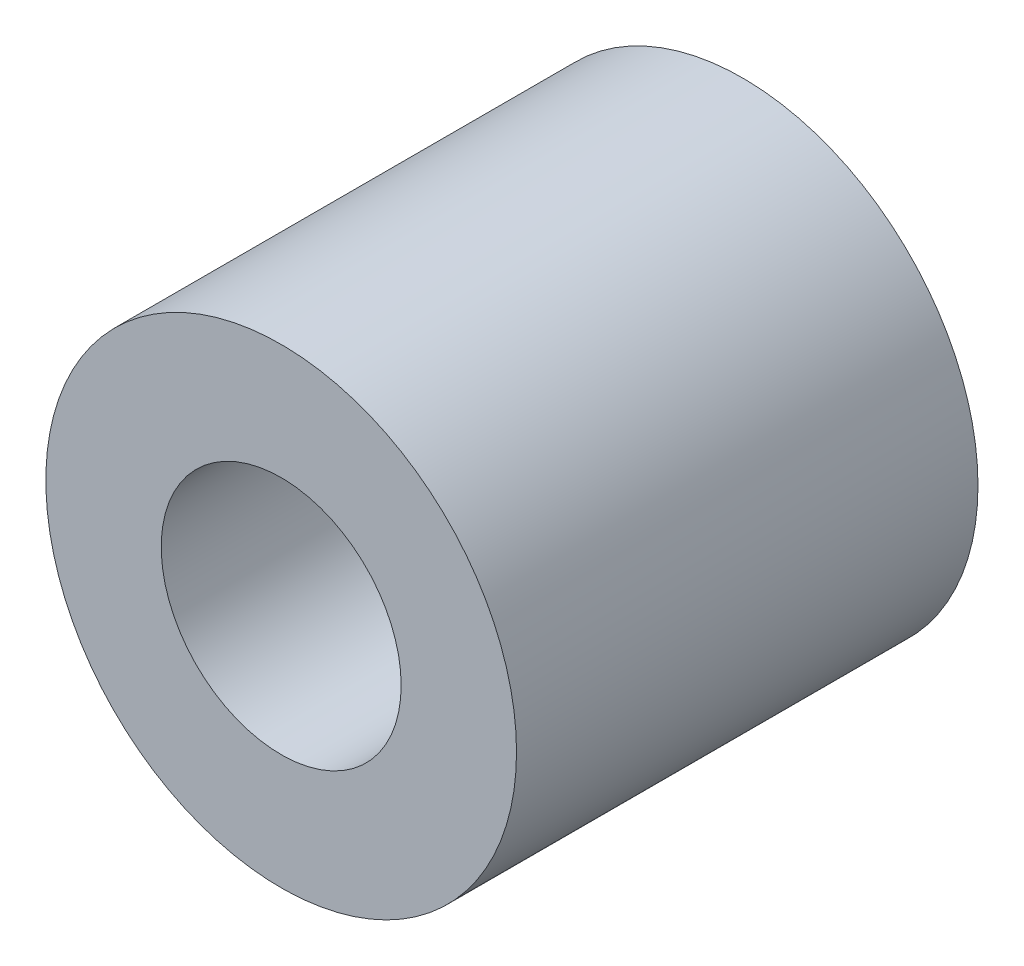
ISO-10303-21;
HEADER;
FILE_DESCRIPTION(('STEP AP214'),'2;1');
FILE_NAME('part.step','',(''),(''),'','','');
FILE_SCHEMA(('AUTOMOTIVE_DESIGN { 1 0 10303 214 1 1 1 1 }'));
ENDSEC;
DATA;
#1=APPLICATION_CONTEXT('core data for automotive mechanical design processes');
#2=APPLICATION_PROTOCOL_DEFINITION('international standard','automotive_design',2000,#1);
#3=PRODUCT_CONTEXT('',#1,'mechanical');
#4=PRODUCT('Part','Part','',(#3));
#5=PRODUCT_RELATED_PRODUCT_CATEGORY('part','',(#4));
#6=PRODUCT_DEFINITION_FORMATION('','',#4);
#7=PRODUCT_DEFINITION_CONTEXT('part definition',#1,'design');
#8=PRODUCT_DEFINITION('design','',#6,#7);
#9=PRODUCT_DEFINITION_SHAPE('','',#8);
#10=(LENGTH_UNIT() NAMED_UNIT(*) SI_UNIT(.MILLI.,.METRE.));
#11=(NAMED_UNIT(*) PLANE_ANGLE_UNIT() SI_UNIT($,.RADIAN.));
#12=(NAMED_UNIT(*) SI_UNIT($,.STERADIAN.) SOLID_ANGLE_UNIT());
#13=UNCERTAINTY_MEASURE_WITH_UNIT(LENGTH_MEASURE(1.E-05),#10,'distance_accuracy_value','');
#14=(GEOMETRIC_REPRESENTATION_CONTEXT(3) GLOBAL_UNCERTAINTY_ASSIGNED_CONTEXT((#13)) GLOBAL_UNIT_ASSIGNED_CONTEXT((#10,
#11,#12)) REPRESENTATION_CONTEXT('',''));
#15=CARTESIAN_POINT('',(0.,0.,0.));
#16=DIRECTION('',(0.,0.,1.));
#17=DIRECTION('',(1.,0.,0.));
#18=AXIS2_PLACEMENT_3D('',#15,#16,#17);
#19=CARTESIAN_POINT('',(0.,0.,10.));
#20=DIRECTION('',(0.,0.,1.));
#21=DIRECTION('',(1.,0.,0.));
#22=AXIS2_PLACEMENT_3D('',#19,#20,#21);
#23=PLANE('',#22);
#24=CARTESIAN_POINT('',(0.,0.,10.));
#25=DIRECTION('',(0.,0.,1.));
#26=DIRECTION('',(1.,0.,0.));
#27=AXIS2_PLACEMENT_3D('',#24,#25,#26);
#28=CIRCLE('',#27,5.1);
#29=CARTESIAN_POINT('',(5.1,0.,10.));
#30=VERTEX_POINT('',#29);
#31=EDGE_CURVE('E10',#30,#30,#28,.T.);
#32=ORIENTED_EDGE('',*,*,#31,.T.);
#33=EDGE_LOOP('',(#32));
#34=FACE_BOUND('',#33,.T.);
#35=CARTESIAN_POINT('',(0.,0.,10.));
#36=DIRECTION('',(0.,0.,1.));
#37=DIRECTION('',(1.,0.,0.));
#38=AXIS2_PLACEMENT_3D('',#35,#36,#37);
#39=CIRCLE('',#38,2.6);
#40=CARTESIAN_POINT('',(2.6,0.,10.));
#41=VERTEX_POINT('',#40);
#42=EDGE_CURVE('E45',#41,#41,#39,.T.);
#43=ORIENTED_EDGE('',*,*,#42,.F.);
#44=EDGE_LOOP('',(#43));
#45=FACE_BOUND('',#44,.T.);
#46=ADVANCED_FACE('F34',(#34,#45),#23,.T.);
#47=CARTESIAN_POINT('',(0.,0.,0.));
#48=DIRECTION('',(0.,0.,1.));
#49=DIRECTION('',(1.,0.,0.));
#50=AXIS2_PLACEMENT_3D('',#47,#48,#49);
#51=PLANE('',#50);
#52=CARTESIAN_POINT('',(0.,0.,0.));
#53=DIRECTION('',(0.,0.,1.));
#54=DIRECTION('',(1.,0.,0.));
#55=AXIS2_PLACEMENT_3D('',#52,#53,#54);
#56=CIRCLE('',#55,5.1);
#57=CARTESIAN_POINT('',(5.1,0.,0.));
#58=VERTEX_POINT('',#57);
#59=EDGE_CURVE('E38',#58,#58,#56,.T.);
#60=ORIENTED_EDGE('',*,*,#59,.F.);
#61=EDGE_LOOP('',(#60));
#62=FACE_BOUND('',#61,.T.);
#63=CARTESIAN_POINT('',(0.,0.,0.));
#64=DIRECTION('',(0.,0.,1.));
#65=DIRECTION('',(1.,0.,0.));
#66=AXIS2_PLACEMENT_3D('',#63,#64,#65);
#67=CIRCLE('',#66,2.6);
#68=CARTESIAN_POINT('',(2.6,0.,0.));
#69=VERTEX_POINT('',#68);
#70=EDGE_CURVE('E47',#69,#69,#67,.T.);
#71=ORIENTED_EDGE('',*,*,#70,.T.);
#72=EDGE_LOOP('',(#71));
#73=FACE_BOUND('',#72,.T.);
#74=ADVANCED_FACE('F57',(#62,#73),#51,.F.);
#75=CARTESIAN_POINT('',(0.,0.,10.));
#76=DIRECTION('',(0.,0.,-1.));
#77=DIRECTION('',(-1.,0.,0.));
#78=AXIS2_PLACEMENT_3D('',#75,#76,#77);
#79=CYLINDRICAL_SURFACE('',#78,5.1);
#80=ORIENTED_EDGE('',*,*,#31,.F.);
#81=EDGE_LOOP('',(#80));
#82=FACE_BOUND('',#81,.T.);
#83=ORIENTED_EDGE('',*,*,#59,.T.);
#84=EDGE_LOOP('',(#83));
#85=FACE_BOUND('',#84,.T.);
#86=ADVANCED_FACE('F36',(#82,#85),#79,.T.);
#87=CARTESIAN_POINT('',(0.,0.,10.));
#88=DIRECTION('',(0.,0.,-1.));
#89=DIRECTION('',(-1.,0.,0.));
#90=AXIS2_PLACEMENT_3D('',#87,#88,#89);
#91=CYLINDRICAL_SURFACE('',#90,2.6);
#92=ORIENTED_EDGE('',*,*,#42,.T.);
#93=EDGE_LOOP('',(#92));
#94=FACE_BOUND('',#93,.T.);
#95=ORIENTED_EDGE('',*,*,#70,.F.);
#96=EDGE_LOOP('',(#95));
#97=FACE_BOUND('',#96,.T.);
#98=ADVANCED_FACE('F53',(#94,#97),#91,.F.);
#99=CLOSED_SHELL('',(#46,#74,#86,#98));
#100=MANIFOLD_SOLID_BREP('B2',#99);
#101=ADVANCED_BREP_SHAPE_REPRESENTATION('',(#18,#100),#14);
#102=SHAPE_DEFINITION_REPRESENTATION(#9,#101);
ENDSEC;
END-ISO-10303-21;
